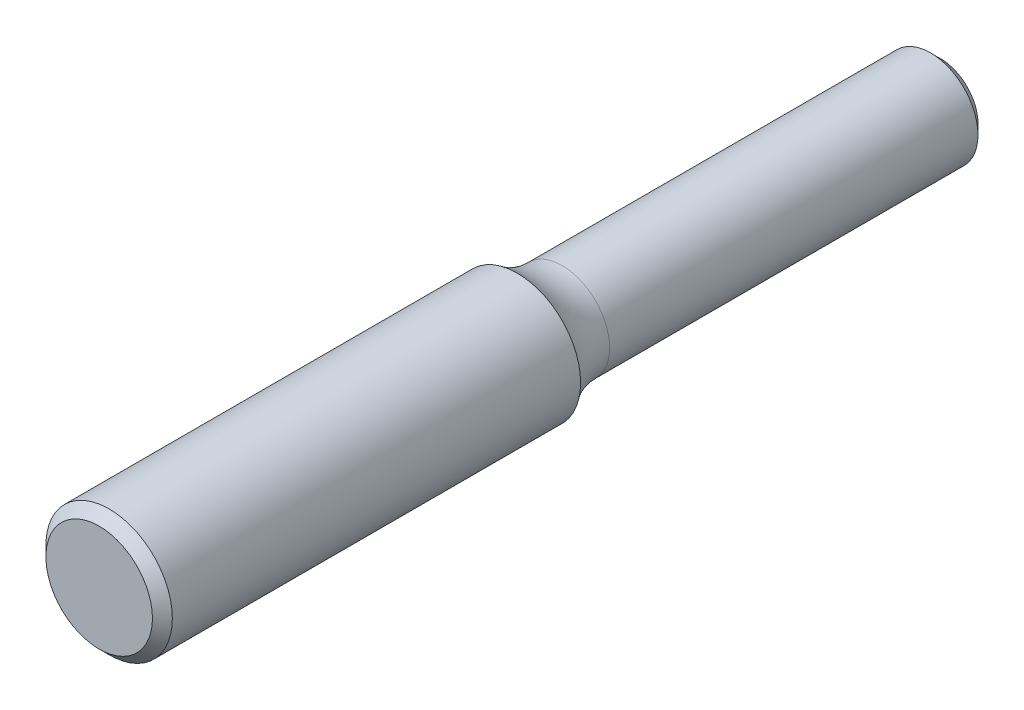
ISO-10303-21;
HEADER;
FILE_DESCRIPTION(('STEP AP214'),'2;1');
FILE_NAME('part.step','',(''),(''),'','','');
FILE_SCHEMA(('AUTOMOTIVE_DESIGN { 1 0 10303 214 1 1 1 1 }'));
ENDSEC;
DATA;
#1=APPLICATION_CONTEXT('core data for automotive mechanical design processes');
#2=APPLICATION_PROTOCOL_DEFINITION('international standard','automotive_design',2000,#1);
#3=PRODUCT_CONTEXT('',#1,'mechanical');
#4=PRODUCT('Part','Part','',(#3));
#5=PRODUCT_RELATED_PRODUCT_CATEGORY('part','',(#4));
#6=PRODUCT_DEFINITION_FORMATION('','',#4);
#7=PRODUCT_DEFINITION_CONTEXT('part definition',#1,'design');
#8=PRODUCT_DEFINITION('design','',#6,#7);
#9=PRODUCT_DEFINITION_SHAPE('','',#8);
#10=(LENGTH_UNIT() NAMED_UNIT(*) SI_UNIT(.MILLI.,.METRE.));
#11=(NAMED_UNIT(*) PLANE_ANGLE_UNIT() SI_UNIT($,.RADIAN.));
#12=(NAMED_UNIT(*) SI_UNIT($,.STERADIAN.) SOLID_ANGLE_UNIT());
#13=UNCERTAINTY_MEASURE_WITH_UNIT(LENGTH_MEASURE(1.E-05),#10,'distance_accuracy_value','');
#14=(GEOMETRIC_REPRESENTATION_CONTEXT(3) GLOBAL_UNCERTAINTY_ASSIGNED_CONTEXT((#13)) GLOBAL_UNIT_ASSIGNED_CONTEXT((#10,
#11,#12)) REPRESENTATION_CONTEXT('',''));
#15=CARTESIAN_POINT('',(0.,0.,0.));
#16=DIRECTION('',(0.,0.,1.));
#17=DIRECTION('',(1.,0.,0.));
#18=AXIS2_PLACEMENT_3D('',#15,#16,#17);
#19=CARTESIAN_POINT('',(0.,0.,42.25));
#20=DIRECTION('',(0.,0.,-1.));
#21=DIRECTION('',(-1.,0.,0.));
#22=AXIS2_PLACEMENT_3D('',#19,#20,#21);
#23=CYLINDRICAL_SURFACE('',#22,3.175);
#24=CARTESIAN_POINT('',(0.,0.,41.75));
#25=DIRECTION('',(0.,0.,1.));
#26=DIRECTION('',(1.,0.,0.));
#27=AXIS2_PLACEMENT_3D('',#24,#25,#26);
#28=CIRCLE('',#27,3.175);
#29=CARTESIAN_POINT('',(3.175,0.,41.75));
#30=VERTEX_POINT('',#29);
#31=EDGE_CURVE('E10',#30,#30,#28,.F.);
#32=ORIENTED_EDGE('',*,*,#31,.T.);
#33=EDGE_LOOP('',(#32));
#34=FACE_BOUND('',#33,.T.);
#35=CARTESIAN_POINT('',(0.,0.,21.25));
#36=DIRECTION('',(0.,0.,1.));
#37=DIRECTION('',(1.,0.,0.));
#38=AXIS2_PLACEMENT_3D('',#35,#36,#37);
#39=CIRCLE('',#38,3.175);
#40=CARTESIAN_POINT('',(3.175,0.,21.25));
#41=VERTEX_POINT('',#40);
#42=EDGE_CURVE('E70',#41,#41,#39,.T.);
#43=ORIENTED_EDGE('',*,*,#42,.T.);
#44=EDGE_LOOP('',(#43));
#45=FACE_BOUND('',#44,.T.);
#46=ADVANCED_FACE('F45',(#34,#45),#23,.T.);
#47=CARTESIAN_POINT('',(0.,0.,42.25));
#48=DIRECTION('',(0.,0.,1.));
#49=DIRECTION('',(1.,0.,0.));
#50=AXIS2_PLACEMENT_3D('',#47,#48,#49);
#51=PLANE('',#50);
#52=CARTESIAN_POINT('',(0.,0.,42.25));
#53=DIRECTION('',(0.,0.,1.));
#54=DIRECTION('',(1.,0.,0.));
#55=AXIS2_PLACEMENT_3D('',#52,#53,#54);
#56=CIRCLE('',#55,2.675);
#57=CARTESIAN_POINT('',(2.675,0.,42.25));
#58=VERTEX_POINT('',#57);
#59=EDGE_CURVE('E54',#58,#58,#56,.T.);
#60=ORIENTED_EDGE('',*,*,#59,.T.);
#61=EDGE_LOOP('',(#60));
#62=FACE_BOUND('',#61,.T.);
#63=ADVANCED_FACE('F95',(#62),#51,.T.);
#64=CARTESIAN_POINT('',(0.,0.,19.));
#65=DIRECTION('',(0.,0.,1.));
#66=DIRECTION('',(1.,0.,0.));
#67=AXIS2_PLACEMENT_3D('',#64,#65,#66);
#68=TOROIDAL_SURFACE('',#67,5.96710137795275,3.58585137795275);
#69=CARTESIAN_POINT('',(0.,0.,19.));
#70=DIRECTION('',(0.,0.,1.));
#71=DIRECTION('',(1.,0.,0.));
#72=AXIS2_PLACEMENT_3D('',#69,#70,#71);
#73=CIRCLE('',#72,2.38125);
#74=CARTESIAN_POINT('',(2.38125,0.,19.));
#75=VERTEX_POINT('',#74);
#76=EDGE_CURVE('E74',#75,#75,#73,.T.);
#77=ORIENTED_EDGE('',*,*,#76,.T.);
#78=EDGE_LOOP('',(#77));
#79=FACE_BOUND('',#78,.T.);
#80=ORIENTED_EDGE('',*,*,#42,.F.);
#81=EDGE_LOOP('',(#80));
#82=FACE_BOUND('',#81,.T.);
#83=ADVANCED_FACE('F79',(#79,#82),#68,.F.);
#84=CARTESIAN_POINT('',(0.,0.,21.25));
#85=DIRECTION('',(0.,0.,1.));
#86=DIRECTION('',(1.,0.,0.));
#87=AXIS2_PLACEMENT_3D('',#84,#85,#86);
#88=CYLINDRICAL_SURFACE('',#87,2.38125);
#89=CARTESIAN_POINT('',(0.,0.,0.5));
#90=DIRECTION('',(0.,0.,1.));
#91=DIRECTION('',(1.,0.,0.));
#92=AXIS2_PLACEMENT_3D('',#89,#90,#91);
#93=CIRCLE('',#92,2.38125);
#94=CARTESIAN_POINT('',(2.38125,0.,0.5));
#95=VERTEX_POINT('',#94);
#96=EDGE_CURVE('E64',#95,#95,#93,.T.);
#97=ORIENTED_EDGE('',*,*,#96,.T.);
#98=EDGE_LOOP('',(#97));
#99=FACE_BOUND('',#98,.T.);
#100=ORIENTED_EDGE('',*,*,#76,.F.);
#101=EDGE_LOOP('',(#100));
#102=FACE_BOUND('',#101,.T.);
#103=ADVANCED_FACE('F82',(#99,#102),#88,.T.);
#104=CARTESIAN_POINT('',(0.,0.,0.));
#105=DIRECTION('',(0.,0.,1.));
#106=DIRECTION('',(1.,0.,0.));
#107=AXIS2_PLACEMENT_3D('',#104,#105,#106);
#108=PLANE('',#107);
#109=CARTESIAN_POINT('',(0.,0.,0.));
#110=DIRECTION('',(0.,0.,1.));
#111=DIRECTION('',(1.,0.,0.));
#112=AXIS2_PLACEMENT_3D('',#109,#110,#111);
#113=CIRCLE('',#112,1.88124999999999);
#114=CARTESIAN_POINT('',(1.88124999999999,0.,0.));
#115=VERTEX_POINT('',#114);
#116=EDGE_CURVE('E59',#115,#115,#113,.F.);
#117=ORIENTED_EDGE('',*,*,#116,.T.);
#118=EDGE_LOOP('',(#117));
#119=FACE_BOUND('',#118,.T.);
#120=ADVANCED_FACE('F84',(#119),#108,.F.);
#121=CARTESIAN_POINT('',(0.,0.,0.5));
#122=DIRECTION('',(0.,0.,1.));
#123=DIRECTION('',(1.,0.,0.));
#124=AXIS2_PLACEMENT_3D('',#121,#122,#123);
#125=CONICAL_SURFACE('',#124,2.38125,0.785398163397454);
#126=ORIENTED_EDGE('',*,*,#116,.F.);
#127=EDGE_LOOP('',(#126));
#128=FACE_BOUND('',#127,.T.);
#129=ORIENTED_EDGE('',*,*,#96,.F.);
#130=EDGE_LOOP('',(#129));
#131=FACE_BOUND('',#130,.T.);
#132=ADVANCED_FACE('F91',(#128,#131),#125,.T.);
#133=CARTESIAN_POINT('',(0.,0.,42.25));
#134=DIRECTION('',(0.,0.,-1.));
#135=DIRECTION('',(-1.,0.,0.));
#136=AXIS2_PLACEMENT_3D('',#133,#134,#135);
#137=CONICAL_SURFACE('',#136,2.675,0.785398163397454);
#138=ORIENTED_EDGE('',*,*,#31,.F.);
#139=EDGE_LOOP('',(#138));
#140=FACE_BOUND('',#139,.T.);
#141=ORIENTED_EDGE('',*,*,#59,.F.);
#142=EDGE_LOOP('',(#141));
#143=FACE_BOUND('',#142,.T.);
#144=ADVANCED_FACE('F48',(#140,#143),#137,.T.);
#145=CLOSED_SHELL('',(#46,#63,#83,#103,#120,#132,#144));
#146=MANIFOLD_SOLID_BREP('B2',#145);
#147=ADVANCED_BREP_SHAPE_REPRESENTATION('',(#18,#146),#14);
#148=SHAPE_DEFINITION_REPRESENTATION(#9,#147);
ENDSEC;
END-ISO-10303-21;
